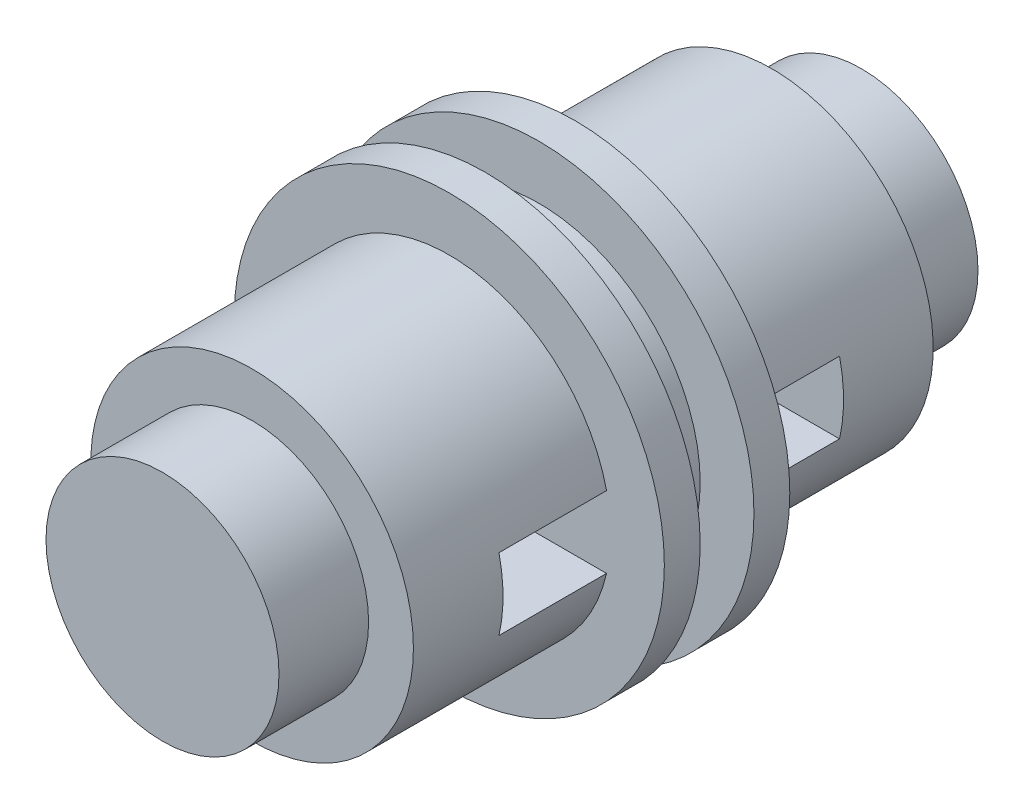
ISO-10303-21;
HEADER;
FILE_DESCRIPTION(('STEP AP214'),'2;1');
FILE_NAME('part.step','',(''),(''),'','','');
FILE_SCHEMA(('AUTOMOTIVE_DESIGN { 1 0 10303 214 1 1 1 1 }'));
ENDSEC;
DATA;
#1=APPLICATION_CONTEXT('core data for automotive mechanical design processes');
#2=APPLICATION_PROTOCOL_DEFINITION('international standard','automotive_design',2000,#1);
#3=PRODUCT_CONTEXT('',#1,'mechanical');
#4=PRODUCT('Part','Part','',(#3));
#5=PRODUCT_RELATED_PRODUCT_CATEGORY('part','',(#4));
#6=PRODUCT_DEFINITION_FORMATION('','',#4);
#7=PRODUCT_DEFINITION_CONTEXT('part definition',#1,'design');
#8=PRODUCT_DEFINITION('design','',#6,#7);
#9=PRODUCT_DEFINITION_SHAPE('','',#8);
#10=(LENGTH_UNIT() NAMED_UNIT(*) SI_UNIT(.MILLI.,.METRE.));
#11=(NAMED_UNIT(*) PLANE_ANGLE_UNIT() SI_UNIT($,.RADIAN.));
#12=(NAMED_UNIT(*) SI_UNIT($,.STERADIAN.) SOLID_ANGLE_UNIT());
#13=UNCERTAINTY_MEASURE_WITH_UNIT(LENGTH_MEASURE(1.E-05),#10,'distance_accuracy_value','');
#14=(GEOMETRIC_REPRESENTATION_CONTEXT(3) GLOBAL_UNCERTAINTY_ASSIGNED_CONTEXT((#13)) GLOBAL_UNIT_ASSIGNED_CONTEXT((#10,
#11,#12)) REPRESENTATION_CONTEXT('',''));
#15=CARTESIAN_POINT('',(0.,0.,0.));
#16=DIRECTION('',(0.,0.,1.));
#17=DIRECTION('',(1.,0.,0.));
#18=AXIS2_PLACEMENT_3D('',#15,#16,#17);
#19=CARTESIAN_POINT('',(0.,0.,3.));
#20=DIRECTION('',(0.,0.,-1.));
#21=DIRECTION('',(-1.,0.,0.));
#22=AXIS2_PLACEMENT_3D('',#19,#20,#21);
#23=CYLINDRICAL_SURFACE('',#22,4.5);
#24=CARTESIAN_POINT('',(0.,0.,0.));
#25=DIRECTION('',(0.,0.,1.));
#26=DIRECTION('',(1.,0.,0.));
#27=AXIS2_PLACEMENT_3D('',#24,#25,#26);
#28=CIRCLE('',#27,4.5);
#29=CARTESIAN_POINT('',(4.38748219369606,1.,0.));
#30=VERTEX_POINT('',#29);
#31=CARTESIAN_POINT('',(-4.38748219369606,1.,0.));
#32=VERTEX_POINT('',#31);
#33=EDGE_CURVE('E162',#30,#32,#28,.T.);
#34=ORIENTED_EDGE('',*,*,#33,.T.);
#35=DIRECTION('',(0.,0.,-1.));
#36=VECTOR('',#35,1.);
#37=CARTESIAN_POINT('',(-4.38748219369606,1.,3.));
#38=LINE('',#37,#36);
#39=CARTESIAN_POINT('',(-4.38748219369606,1.,3.));
#40=VERTEX_POINT('',#39);
#41=EDGE_CURVE('E196',#32,#40,#38,.F.);
#42=ORIENTED_EDGE('',*,*,#41,.T.);
#43=CARTESIAN_POINT('',(0.,0.,3.));
#44=DIRECTION('',(0.,0.,1.));
#45=DIRECTION('',(1.,0.,0.));
#46=AXIS2_PLACEMENT_3D('',#43,#44,#45);
#47=CIRCLE('',#46,4.5);
#48=CARTESIAN_POINT('',(-4.38748219369606,-1.,3.));
#49=VERTEX_POINT('',#48);
#50=EDGE_CURVE('E45',#40,#49,#47,.T.);
#51=ORIENTED_EDGE('',*,*,#50,.T.);
#52=DIRECTION('',(0.,0.,-1.));
#53=VECTOR('',#52,1.);
#54=CARTESIAN_POINT('',(-4.38748219369606,-1.,3.));
#55=LINE('',#54,#53);
#56=CARTESIAN_POINT('',(-4.38748219369606,-1.,0.));
#57=VERTEX_POINT('',#56);
#58=EDGE_CURVE('E179',#49,#57,#55,.T.);
#59=ORIENTED_EDGE('',*,*,#58,.T.);
#60=CARTESIAN_POINT('',(4.38748219369606,-1.,0.));
#61=VERTEX_POINT('',#60);
#62=EDGE_CURVE('E166',#57,#61,#28,.T.);
#63=ORIENTED_EDGE('',*,*,#62,.T.);
#64=DIRECTION('',(0.,0.,-1.));
#65=VECTOR('',#64,1.);
#66=CARTESIAN_POINT('',(4.38748219369606,-1.,3.));
#67=LINE('',#66,#65);
#68=CARTESIAN_POINT('',(4.38748219369606,-1.,3.));
#69=VERTEX_POINT('',#68);
#70=EDGE_CURVE('E177',#61,#69,#67,.F.);
#71=ORIENTED_EDGE('',*,*,#70,.T.);
#72=CARTESIAN_POINT('',(4.38748219369606,1.,3.));
#73=VERTEX_POINT('',#72);
#74=EDGE_CURVE('E11',#69,#73,#47,.T.);
#75=ORIENTED_EDGE('',*,*,#74,.T.);
#76=DIRECTION('',(0.,0.,-1.));
#77=VECTOR('',#76,1.);
#78=CARTESIAN_POINT('',(4.38748219369606,1.,3.));
#79=LINE('',#78,#77);
#80=EDGE_CURVE('E198',#73,#30,#79,.T.);
#81=ORIENTED_EDGE('',*,*,#80,.T.);
#82=EDGE_LOOP('',(#34,#42,#51,#59,#63,#71,#75,#81));
#83=FACE_BOUND('',#82,.T.);
#84=CARTESIAN_POINT('',(0.,0.,5.5));
#85=DIRECTION('',(0.,0.,1.));
#86=DIRECTION('',(1.,0.,0.));
#87=AXIS2_PLACEMENT_3D('',#84,#85,#86);
#88=CIRCLE('',#87,4.5);
#89=CARTESIAN_POINT('',(4.5,0.,5.5));
#90=VERTEX_POINT('',#89);
#91=EDGE_CURVE('E203',#90,#90,#88,.T.);
#92=ORIENTED_EDGE('',*,*,#91,.F.);
#93=EDGE_LOOP('',(#92));
#94=FACE_BOUND('',#93,.T.);
#95=ADVANCED_FACE('F42',(#83,#94),#23,.T.);
#96=CARTESIAN_POINT('',(0.,0.,-1.));
#97=DIRECTION('',(0.,0.,1.));
#98=DIRECTION('',(1.,0.,0.));
#99=AXIS2_PLACEMENT_3D('',#96,#97,#98);
#100=CYLINDRICAL_SURFACE('',#99,6.);
#101=CARTESIAN_POINT('',(0.,0.,-1.));
#102=DIRECTION('',(0.,0.,-1.));
#103=DIRECTION('',(-1.,0.,0.));
#104=AXIS2_PLACEMENT_3D('',#101,#102,#103);
#105=CIRCLE('',#104,6.);
#106=CARTESIAN_POINT('',(-6.,0.,-1.));
#107=VERTEX_POINT('',#106);
#108=EDGE_CURVE('E163',#107,#107,#105,.T.);
#109=ORIENTED_EDGE('',*,*,#108,.F.);
#110=EDGE_LOOP('',(#109));
#111=FACE_BOUND('',#110,.T.);
#112=CARTESIAN_POINT('',(0.,0.,0.));
#113=DIRECTION('',(0.,0.,-1.));
#114=DIRECTION('',(-1.,0.,0.));
#115=AXIS2_PLACEMENT_3D('',#112,#113,#114);
#116=CIRCLE('',#115,6.);
#117=CARTESIAN_POINT('',(-6.,0.,0.));
#118=VERTEX_POINT('',#117);
#119=EDGE_CURVE('E159',#118,#118,#116,.T.);
#120=ORIENTED_EDGE('',*,*,#119,.T.);
#121=EDGE_LOOP('',(#120));
#122=FACE_BOUND('',#121,.T.);
#123=ADVANCED_FACE('F229',(#111,#122),#100,.T.);
#124=CARTESIAN_POINT('',(0.,0.,-1.));
#125=DIRECTION('',(0.,0.,-1.));
#126=DIRECTION('',(-1.,0.,0.));
#127=AXIS2_PLACEMENT_3D('',#124,#125,#126);
#128=PLANE('',#127);
#129=CARTESIAN_POINT('',(0.,0.,-1.));
#130=DIRECTION('',(0.,0.,-1.));
#131=DIRECTION('',(-1.,0.,0.));
#132=AXIS2_PLACEMENT_3D('',#129,#130,#131);
#133=CIRCLE('',#132,4.5);
#134=CARTESIAN_POINT('',(-4.5,0.,-1.));
#135=VERTEX_POINT('',#134);
#136=EDGE_CURVE('E149',#135,#135,#133,.T.);
#137=ORIENTED_EDGE('',*,*,#136,.F.);
#138=EDGE_LOOP('',(#137));
#139=FACE_BOUND('',#138,.T.);
#140=ORIENTED_EDGE('',*,*,#108,.T.);
#141=EDGE_LOOP('',(#140));
#142=FACE_BOUND('',#141,.T.);
#143=ADVANCED_FACE('F233',(#139,#142),#128,.T.);
#144=CARTESIAN_POINT('',(0.,0.,0.));
#145=DIRECTION('',(0.,0.,-1.));
#146=DIRECTION('',(-1.,0.,0.));
#147=AXIS2_PLACEMENT_3D('',#144,#145,#146);
#148=PLANE('',#147);
#149=ORIENTED_EDGE('',*,*,#33,.F.);
#150=DIRECTION('',(-1.,0.,0.));
#151=VECTOR('',#150,1.);
#152=CARTESIAN_POINT('',(25.45,1.,0.));
#153=LINE('',#152,#151);
#154=EDGE_CURVE('E190',#30,#32,#153,.T.);
#155=ORIENTED_EDGE('',*,*,#154,.T.);
#156=EDGE_LOOP('',(#149,#155));
#157=FACE_BOUND('',#156,.T.);
#158=DIRECTION('',(-1.,0.,0.));
#159=VECTOR('',#158,1.);
#160=CARTESIAN_POINT('',(25.45,-1.,0.));
#161=LINE('',#160,#159);
#162=EDGE_CURVE('E61',#61,#57,#161,.T.);
#163=ORIENTED_EDGE('',*,*,#162,.F.);
#164=ORIENTED_EDGE('',*,*,#62,.F.);
#165=EDGE_LOOP('',(#163,#164));
#166=FACE_BOUND('',#165,.T.);
#167=ORIENTED_EDGE('',*,*,#119,.F.);
#168=EDGE_LOOP('',(#167));
#169=FACE_BOUND('',#168,.T.);
#170=ADVANCED_FACE('F181',(#157,#166,#169),#148,.F.);
#171=CARTESIAN_POINT('',(0.,0.,-2.5));
#172=DIRECTION('',(0.,0.,1.));
#173=DIRECTION('',(1.,0.,0.));
#174=AXIS2_PLACEMENT_3D('',#171,#172,#173);
#175=CYLINDRICAL_SURFACE('',#174,4.5);
#176=CARTESIAN_POINT('',(0.,0.,-2.5));
#177=DIRECTION('',(0.,0.,-1.));
#178=DIRECTION('',(-1.,0.,0.));
#179=AXIS2_PLACEMENT_3D('',#176,#177,#178);
#180=CIRCLE('',#179,4.5);
#181=CARTESIAN_POINT('',(-4.5,0.,-2.5));
#182=VERTEX_POINT('',#181);
#183=EDGE_CURVE('E153',#182,#182,#180,.T.);
#184=ORIENTED_EDGE('',*,*,#183,.F.);
#185=EDGE_LOOP('',(#184));
#186=FACE_BOUND('',#185,.T.);
#187=ORIENTED_EDGE('',*,*,#136,.T.);
#188=EDGE_LOOP('',(#187));
#189=FACE_BOUND('',#188,.T.);
#190=ADVANCED_FACE('F244',(#186,#189),#175,.T.);
#191=CARTESIAN_POINT('',(0.,0.,-3.5));
#192=DIRECTION('',(0.,0.,1.));
#193=DIRECTION('',(1.,0.,0.));
#194=AXIS2_PLACEMENT_3D('',#191,#192,#193);
#195=CYLINDRICAL_SURFACE('',#194,6.);
#196=CARTESIAN_POINT('',(0.,0.,-3.5));
#197=DIRECTION('',(0.,0.,-1.));
#198=DIRECTION('',(-1.,0.,0.));
#199=AXIS2_PLACEMENT_3D('',#196,#197,#198);
#200=CIRCLE('',#199,6.);
#201=CARTESIAN_POINT('',(-6.,0.,-3.5));
#202=VERTEX_POINT('',#201);
#203=EDGE_CURVE('E150',#202,#202,#200,.T.);
#204=ORIENTED_EDGE('',*,*,#203,.F.);
#205=EDGE_LOOP('',(#204));
#206=FACE_BOUND('',#205,.T.);
#207=CARTESIAN_POINT('',(0.,0.,-2.5));
#208=DIRECTION('',(0.,0.,-1.));
#209=DIRECTION('',(-1.,0.,0.));
#210=AXIS2_PLACEMENT_3D('',#207,#208,#209);
#211=CIRCLE('',#210,6.);
#212=CARTESIAN_POINT('',(-6.,0.,-2.5));
#213=VERTEX_POINT('',#212);
#214=EDGE_CURVE('E154',#213,#213,#211,.T.);
#215=ORIENTED_EDGE('',*,*,#214,.T.);
#216=EDGE_LOOP('',(#215));
#217=FACE_BOUND('',#216,.T.);
#218=ADVANCED_FACE('F249',(#206,#217),#195,.T.);
#219=CARTESIAN_POINT('',(0.,0.,-3.5));
#220=DIRECTION('',(0.,0.,-1.));
#221=DIRECTION('',(-1.,0.,0.));
#222=AXIS2_PLACEMENT_3D('',#219,#220,#221);
#223=PLANE('',#222);
#224=CARTESIAN_POINT('',(0.,0.,-3.5));
#225=DIRECTION('',(0.,0.,-1.));
#226=DIRECTION('',(-1.,0.,0.));
#227=AXIS2_PLACEMENT_3D('',#224,#225,#226);
#228=CIRCLE('',#227,4.5);
#229=CARTESIAN_POINT('',(-4.38748219369606,1.,-3.5));
#230=VERTEX_POINT('',#229);
#231=CARTESIAN_POINT('',(4.38748219369606,1.,-3.5));
#232=VERTEX_POINT('',#231);
#233=EDGE_CURVE('E139',#230,#232,#228,.T.);
#234=ORIENTED_EDGE('',*,*,#233,.F.);
#235=DIRECTION('',(-1.,0.,0.));
#236=VECTOR('',#235,1.);
#237=CARTESIAN_POINT('',(25.45,1.,-3.5));
#238=LINE('',#237,#236);
#239=EDGE_CURVE('E521',#232,#230,#238,.T.);
#240=ORIENTED_EDGE('',*,*,#239,.F.);
#241=EDGE_LOOP('',(#234,#240));
#242=FACE_BOUND('',#241,.T.);
#243=ORIENTED_EDGE('',*,*,#203,.T.);
#244=EDGE_LOOP('',(#243));
#245=FACE_BOUND('',#244,.T.);
#246=CARTESIAN_POINT('',(4.38748219369606,-1.,-3.5));
#247=VERTEX_POINT('',#246);
#248=CARTESIAN_POINT('',(-4.38748219369606,-1.,-3.5));
#249=VERTEX_POINT('',#248);
#250=EDGE_CURVE('E143',#247,#249,#228,.T.);
#251=ORIENTED_EDGE('',*,*,#250,.F.);
#252=DIRECTION('',(-1.,0.,0.));
#253=VECTOR('',#252,1.);
#254=CARTESIAN_POINT('',(25.45,-1.,-3.5));
#255=LINE('',#254,#253);
#256=EDGE_CURVE('E110',#247,#249,#255,.T.);
#257=ORIENTED_EDGE('',*,*,#256,.T.);
#258=EDGE_LOOP('',(#251,#257));
#259=FACE_BOUND('',#258,.T.);
#260=ADVANCED_FACE('F253',(#242,#245,#259),#223,.T.);
#261=CARTESIAN_POINT('',(0.,0.,-2.5));
#262=DIRECTION('',(0.,0.,-1.));
#263=DIRECTION('',(-1.,0.,0.));
#264=AXIS2_PLACEMENT_3D('',#261,#262,#263);
#265=PLANE('',#264);
#266=ORIENTED_EDGE('',*,*,#183,.T.);
#267=EDGE_LOOP('',(#266));
#268=FACE_BOUND('',#267,.T.);
#269=ORIENTED_EDGE('',*,*,#214,.F.);
#270=EDGE_LOOP('',(#269));
#271=FACE_BOUND('',#270,.T.);
#272=ADVANCED_FACE('F255',(#268,#271),#265,.F.);
#273=CARTESIAN_POINT('',(0.,0.,-6.5));
#274=DIRECTION('',(0.,0.,1.));
#275=DIRECTION('',(1.,0.,0.));
#276=AXIS2_PLACEMENT_3D('',#273,#274,#275);
#277=CYLINDRICAL_SURFACE('',#276,4.5);
#278=CARTESIAN_POINT('',(0.,0.,-6.5));
#279=DIRECTION('',(0.,0.,-1.));
#280=DIRECTION('',(-1.,0.,0.));
#281=AXIS2_PLACEMENT_3D('',#278,#279,#280);
#282=CIRCLE('',#281,4.5);
#283=CARTESIAN_POINT('',(-4.38748219369606,-1.,-6.5));
#284=VERTEX_POINT('',#283);
#285=CARTESIAN_POINT('',(-4.38748219369606,1.,-6.5));
#286=VERTEX_POINT('',#285);
#287=EDGE_CURVE('E122',#284,#286,#282,.T.);
#288=ORIENTED_EDGE('',*,*,#287,.T.);
#289=DIRECTION('',(0.,0.,1.));
#290=VECTOR('',#289,1.);
#291=CARTESIAN_POINT('',(-4.38748219369606,1.,-6.5));
#292=LINE('',#291,#290);
#293=EDGE_CURVE('E131',#286,#230,#292,.T.);
#294=ORIENTED_EDGE('',*,*,#293,.T.);
#295=ORIENTED_EDGE('',*,*,#233,.T.);
#296=DIRECTION('',(0.,0.,1.));
#297=VECTOR('',#296,1.);
#298=CARTESIAN_POINT('',(4.38748219369606,1.,-6.5));
#299=LINE('',#298,#297);
#300=CARTESIAN_POINT('',(4.38748219369606,1.,-6.5));
#301=VERTEX_POINT('',#300);
#302=EDGE_CURVE('E129',#232,#301,#299,.F.);
#303=ORIENTED_EDGE('',*,*,#302,.T.);
#304=CARTESIAN_POINT('',(4.38748219369606,-1.,-6.5));
#305=VERTEX_POINT('',#304);
#306=EDGE_CURVE('E115',#301,#305,#282,.T.);
#307=ORIENTED_EDGE('',*,*,#306,.T.);
#308=DIRECTION('',(0.,0.,1.));
#309=VECTOR('',#308,1.);
#310=CARTESIAN_POINT('',(4.38748219369606,-1.,-6.5));
#311=LINE('',#310,#309);
#312=EDGE_CURVE('E104',#305,#247,#311,.T.);
#313=ORIENTED_EDGE('',*,*,#312,.T.);
#314=ORIENTED_EDGE('',*,*,#250,.T.);
#315=DIRECTION('',(0.,0.,1.));
#316=VECTOR('',#315,1.);
#317=CARTESIAN_POINT('',(-4.38748219369606,-1.,-6.5));
#318=LINE('',#317,#316);
#319=EDGE_CURVE('E116',#249,#284,#318,.F.);
#320=ORIENTED_EDGE('',*,*,#319,.T.);
#321=EDGE_LOOP('',(#288,#294,#295,#303,#307,#313,#314,#320));
#322=FACE_BOUND('',#321,.T.);
#323=CARTESIAN_POINT('',(0.,0.,-9.));
#324=DIRECTION('',(0.,0.,-1.));
#325=DIRECTION('',(-1.,0.,0.));
#326=AXIS2_PLACEMENT_3D('',#323,#324,#325);
#327=CIRCLE('',#326,4.5);
#328=CARTESIAN_POINT('',(-4.5,0.,-9.));
#329=VERTEX_POINT('',#328);
#330=EDGE_CURVE('E200',#329,#329,#327,.T.);
#331=ORIENTED_EDGE('',*,*,#330,.F.);
#332=EDGE_LOOP('',(#331));
#333=FACE_BOUND('',#332,.T.);
#334=ADVANCED_FACE('F126',(#322,#333),#277,.T.);
#335=CARTESIAN_POINT('',(0.,0.,8.));
#336=DIRECTION('',(0.,0.,1.));
#337=DIRECTION('',(1.,0.,0.));
#338=AXIS2_PLACEMENT_3D('',#335,#336,#337);
#339=PLANE('',#338);
#340=CARTESIAN_POINT('',(0.,0.,8.));
#341=DIRECTION('',(0.,0.,1.));
#342=DIRECTION('',(1.,0.,0.));
#343=AXIS2_PLACEMENT_3D('',#340,#341,#342);
#344=CIRCLE('',#343,3.25);
#345=CARTESIAN_POINT('',(3.25,0.,8.));
#346=VERTEX_POINT('',#345);
#347=EDGE_CURVE('E146',#346,#346,#344,.T.);
#348=ORIENTED_EDGE('',*,*,#347,.T.);
#349=EDGE_LOOP('',(#348));
#350=FACE_BOUND('',#349,.T.);
#351=ADVANCED_FACE('F264',(#350),#339,.T.);
#352=CARTESIAN_POINT('',(0.,0.,8.));
#353=DIRECTION('',(0.,0.,-1.));
#354=DIRECTION('',(-1.,0.,0.));
#355=AXIS2_PLACEMENT_3D('',#352,#353,#354);
#356=CYLINDRICAL_SURFACE('',#355,3.25);
#357=ORIENTED_EDGE('',*,*,#347,.F.);
#358=EDGE_LOOP('',(#357));
#359=FACE_BOUND('',#358,.T.);
#360=CARTESIAN_POINT('',(0.,0.,5.5));
#361=DIRECTION('',(0.,0.,1.));
#362=DIRECTION('',(1.,0.,0.));
#363=AXIS2_PLACEMENT_3D('',#360,#361,#362);
#364=CIRCLE('',#363,3.25);
#365=CARTESIAN_POINT('',(3.25,0.,5.5));
#366=VERTEX_POINT('',#365);
#367=EDGE_CURVE('E135',#366,#366,#364,.T.);
#368=ORIENTED_EDGE('',*,*,#367,.T.);
#369=EDGE_LOOP('',(#368));
#370=FACE_BOUND('',#369,.T.);
#371=ADVANCED_FACE('F267',(#359,#370),#356,.T.);
#372=CARTESIAN_POINT('',(0.,0.,5.5));
#373=DIRECTION('',(0.,0.,1.));
#374=DIRECTION('',(1.,0.,0.));
#375=AXIS2_PLACEMENT_3D('',#372,#373,#374);
#376=PLANE('',#375);
#377=ORIENTED_EDGE('',*,*,#367,.F.);
#378=EDGE_LOOP('',(#377));
#379=FACE_BOUND('',#378,.T.);
#380=ORIENTED_EDGE('',*,*,#91,.T.);
#381=EDGE_LOOP('',(#380));
#382=FACE_BOUND('',#381,.T.);
#383=ADVANCED_FACE('F225',(#379,#382),#376,.T.);
#384=CARTESIAN_POINT('',(0.,0.,-11.5));
#385=DIRECTION('',(0.,0.,-1.));
#386=DIRECTION('',(1.,0.,0.));
#387=AXIS2_PLACEMENT_3D('',#384,#385,#386);
#388=PLANE('',#387);
#389=CARTESIAN_POINT('',(0.,0.,-11.5));
#390=DIRECTION('',(0.,0.,1.));
#391=DIRECTION('',(1.,0.,0.));
#392=AXIS2_PLACEMENT_3D('',#389,#390,#391);
#393=CIRCLE('',#392,3.25);
#394=CARTESIAN_POINT('',(3.25,0.,-11.5));
#395=VERTEX_POINT('',#394);
#396=EDGE_CURVE('E207',#395,#395,#393,.T.);
#397=ORIENTED_EDGE('',*,*,#396,.F.);
#398=EDGE_LOOP('',(#397));
#399=FACE_BOUND('',#398,.T.);
#400=ADVANCED_FACE('F217',(#399),#388,.T.);
#401=CARTESIAN_POINT('',(0.,0.,-11.5));
#402=DIRECTION('',(0.,0.,1.));
#403=DIRECTION('',(1.,0.,0.));
#404=AXIS2_PLACEMENT_3D('',#401,#402,#403);
#405=CYLINDRICAL_SURFACE('',#404,3.25);
#406=ORIENTED_EDGE('',*,*,#396,.T.);
#407=EDGE_LOOP('',(#406));
#408=FACE_BOUND('',#407,.T.);
#409=CARTESIAN_POINT('',(0.,0.,-9.));
#410=DIRECTION('',(0.,0.,1.));
#411=DIRECTION('',(1.,0.,0.));
#412=AXIS2_PLACEMENT_3D('',#409,#410,#411);
#413=CIRCLE('',#412,3.25);
#414=CARTESIAN_POINT('',(3.25,0.,-9.));
#415=VERTEX_POINT('',#414);
#416=EDGE_CURVE('E206',#415,#415,#413,.T.);
#417=ORIENTED_EDGE('',*,*,#416,.F.);
#418=EDGE_LOOP('',(#417));
#419=FACE_BOUND('',#418,.T.);
#420=ADVANCED_FACE('F215',(#408,#419),#405,.T.);
#421=CARTESIAN_POINT('',(0.,0.,-9.));
#422=DIRECTION('',(0.,0.,-1.));
#423=DIRECTION('',(1.,0.,0.));
#424=AXIS2_PLACEMENT_3D('',#421,#422,#423);
#425=PLANE('',#424);
#426=ORIENTED_EDGE('',*,*,#416,.T.);
#427=EDGE_LOOP('',(#426));
#428=FACE_BOUND('',#427,.T.);
#429=ORIENTED_EDGE('',*,*,#330,.T.);
#430=EDGE_LOOP('',(#429));
#431=FACE_BOUND('',#430,.T.);
#432=ADVANCED_FACE('F212',(#428,#431),#425,.T.);
#433=CARTESIAN_POINT('',(25.45,-1.,-6.5));
#434=DIRECTION('',(0.,0.,-1.));
#435=DIRECTION('',(-1.,0.,0.));
#436=AXIS2_PLACEMENT_3D('',#433,#434,#435);
#437=PLANE('',#436);
#438=DIRECTION('',(-1.,0.,0.));
#439=VECTOR('',#438,1.);
#440=CARTESIAN_POINT('',(25.45,1.,-6.5));
#441=LINE('',#440,#439);
#442=EDGE_CURVE('E194',#301,#286,#441,.T.);
#443=ORIENTED_EDGE('',*,*,#442,.T.);
#444=ORIENTED_EDGE('',*,*,#287,.F.);
#445=DIRECTION('',(-1.,0.,0.));
#446=VECTOR('',#445,1.);
#447=CARTESIAN_POINT('',(25.45,-1.,-6.5));
#448=LINE('',#447,#446);
#449=EDGE_CURVE('E107',#305,#284,#448,.T.);
#450=ORIENTED_EDGE('',*,*,#449,.F.);
#451=ORIENTED_EDGE('',*,*,#306,.F.);
#452=EDGE_LOOP('',(#443,#444,#450,#451));
#453=FACE_BOUND('',#452,.T.);
#454=ADVANCED_FACE('F120',(#453),#437,.F.);
#455=CARTESIAN_POINT('',(25.45,1.,-6.5));
#456=DIRECTION('',(0.,1.,0.));
#457=DIRECTION('',(0.,0.,1.));
#458=AXIS2_PLACEMENT_3D('',#455,#456,#457);
#459=PLANE('',#458);
#460=ORIENTED_EDGE('',*,*,#442,.F.);
#461=ORIENTED_EDGE('',*,*,#302,.F.);
#462=ORIENTED_EDGE('',*,*,#239,.T.);
#463=ORIENTED_EDGE('',*,*,#293,.F.);
#464=EDGE_LOOP('',(#460,#461,#462,#463));
#465=FACE_BOUND('',#464,.T.);
#466=ADVANCED_FACE('F314',(#465),#459,.F.);
#467=CARTESIAN_POINT('',(25.45,-1.,-6.5));
#468=DIRECTION('',(0.,-1.,0.));
#469=DIRECTION('',(0.,0.,-1.));
#470=AXIS2_PLACEMENT_3D('',#467,#468,#469);
#471=PLANE('',#470);
#472=ORIENTED_EDGE('',*,*,#449,.T.);
#473=ORIENTED_EDGE('',*,*,#319,.F.);
#474=ORIENTED_EDGE('',*,*,#256,.F.);
#475=ORIENTED_EDGE('',*,*,#312,.F.);
#476=EDGE_LOOP('',(#472,#473,#474,#475));
#477=FACE_BOUND('',#476,.T.);
#478=ADVANCED_FACE('F106',(#477),#471,.F.);
#479=CARTESIAN_POINT('',(25.45,-1.,3.));
#480=DIRECTION('',(0.,0.,1.));
#481=DIRECTION('',(1.,0.,0.));
#482=AXIS2_PLACEMENT_3D('',#479,#480,#481);
#483=PLANE('',#482);
#484=DIRECTION('',(-1.,0.,0.));
#485=VECTOR('',#484,1.);
#486=CARTESIAN_POINT('',(25.45,1.,3.));
#487=LINE('',#486,#485);
#488=EDGE_CURVE('E184',#73,#40,#487,.T.);
#489=ORIENTED_EDGE('',*,*,#488,.F.);
#490=ORIENTED_EDGE('',*,*,#74,.F.);
#491=DIRECTION('',(-1.,0.,0.));
#492=VECTOR('',#491,1.);
#493=CARTESIAN_POINT('',(25.45,-1.,3.));
#494=LINE('',#493,#492);
#495=EDGE_CURVE('E56',#69,#49,#494,.T.);
#496=ORIENTED_EDGE('',*,*,#495,.T.);
#497=ORIENTED_EDGE('',*,*,#50,.F.);
#498=EDGE_LOOP('',(#489,#490,#496,#497));
#499=FACE_BOUND('',#498,.T.);
#500=ADVANCED_FACE('F334',(#499),#483,.F.);
#501=CARTESIAN_POINT('',(25.45,1.,0.));
#502=DIRECTION('',(0.,1.,0.));
#503=DIRECTION('',(0.,0.,1.));
#504=AXIS2_PLACEMENT_3D('',#501,#502,#503);
#505=PLANE('',#504);
#506=ORIENTED_EDGE('',*,*,#488,.T.);
#507=ORIENTED_EDGE('',*,*,#41,.F.);
#508=ORIENTED_EDGE('',*,*,#154,.F.);
#509=ORIENTED_EDGE('',*,*,#80,.F.);
#510=EDGE_LOOP('',(#506,#507,#508,#509));
#511=FACE_BOUND('',#510,.T.);
#512=ADVANCED_FACE('F344',(#511),#505,.F.);
#513=CARTESIAN_POINT('',(25.45,-1.,0.));
#514=DIRECTION('',(0.,-1.,0.));
#515=DIRECTION('',(0.,0.,-1.));
#516=AXIS2_PLACEMENT_3D('',#513,#514,#515);
#517=PLANE('',#516);
#518=ORIENTED_EDGE('',*,*,#495,.F.);
#519=ORIENTED_EDGE('',*,*,#70,.F.);
#520=ORIENTED_EDGE('',*,*,#162,.T.);
#521=ORIENTED_EDGE('',*,*,#58,.F.);
#522=EDGE_LOOP('',(#518,#519,#520,#521));
#523=FACE_BOUND('',#522,.T.);
#524=ADVANCED_FACE('F355',(#523),#517,.F.);
#525=CLOSED_SHELL('',(#95,#123,#143,#170,#190,#218,#260,#272,#334,#351,#371,#383,#400,#420,#432,
#454,#466,#478,#500,#512,#524));
#526=MANIFOLD_SOLID_BREP('B2',#525);
#527=ADVANCED_BREP_SHAPE_REPRESENTATION('',(#18,#526),#14);
#528=SHAPE_DEFINITION_REPRESENTATION(#9,#527);
ENDSEC;
END-ISO-10303-21;
